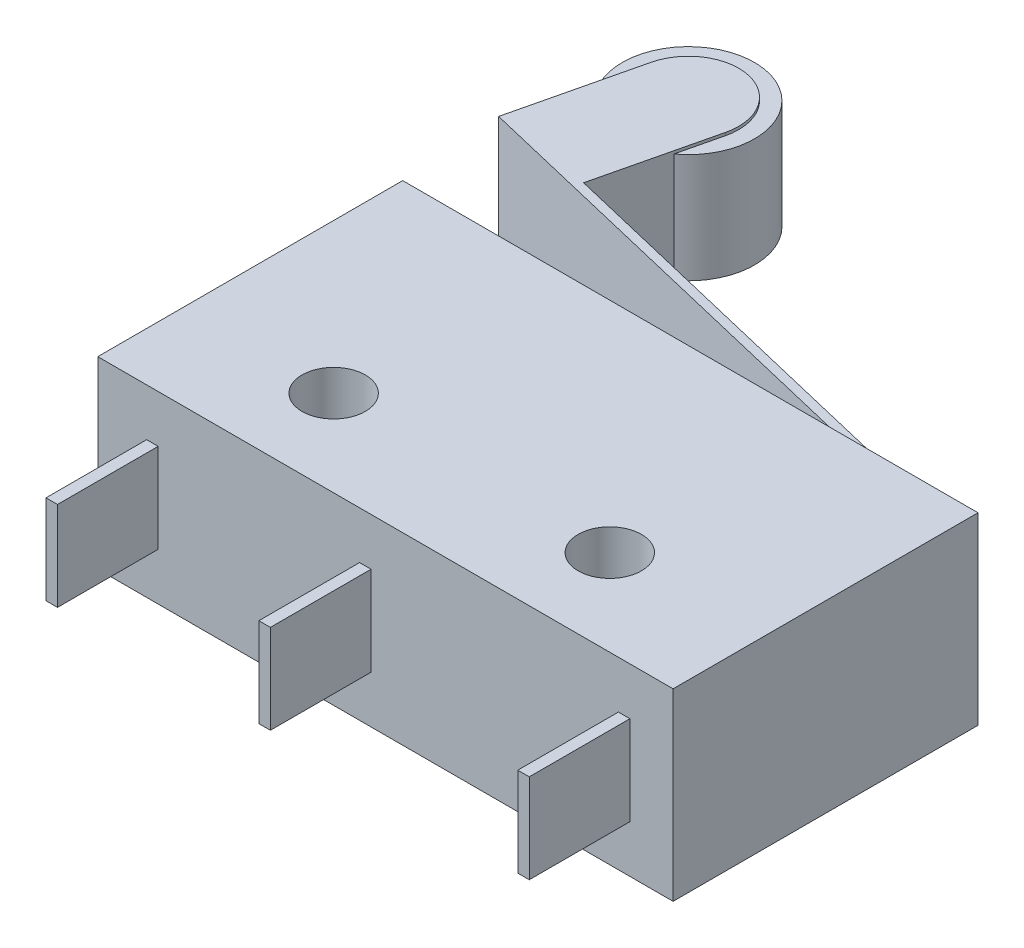
ISO-10303-21;
HEADER;
FILE_DESCRIPTION(('STEP AP214'),'2;1');
FILE_NAME('part.step','',(''),(''),'','','');
FILE_SCHEMA(('AUTOMOTIVE_DESIGN { 1 0 10303 214 1 1 1 1 }'));
ENDSEC;
DATA;
#1=APPLICATION_CONTEXT('core data for automotive mechanical design processes');
#2=APPLICATION_PROTOCOL_DEFINITION('international standard','automotive_design',2000,#1);
#3=PRODUCT_CONTEXT('',#1,'mechanical');
#4=PRODUCT('Part','Part','',(#3));
#5=PRODUCT_RELATED_PRODUCT_CATEGORY('part','',(#4));
#6=PRODUCT_DEFINITION_FORMATION('','',#4);
#7=PRODUCT_DEFINITION_CONTEXT('part definition',#1,'design');
#8=PRODUCT_DEFINITION('design','',#6,#7);
#9=PRODUCT_DEFINITION_SHAPE('','',#8);
#10=(LENGTH_UNIT() NAMED_UNIT(*) SI_UNIT(.MILLI.,.METRE.));
#11=(NAMED_UNIT(*) PLANE_ANGLE_UNIT() SI_UNIT($,.RADIAN.));
#12=(NAMED_UNIT(*) SI_UNIT($,.STERADIAN.) SOLID_ANGLE_UNIT());
#13=UNCERTAINTY_MEASURE_WITH_UNIT(LENGTH_MEASURE(1.E-05),#10,'distance_accuracy_value','');
#14=(GEOMETRIC_REPRESENTATION_CONTEXT(3) GLOBAL_UNCERTAINTY_ASSIGNED_CONTEXT((#13)) GLOBAL_UNIT_ASSIGNED_CONTEXT((#10,
#11,#12)) REPRESENTATION_CONTEXT('',''));
#15=CARTESIAN_POINT('',(0.,0.,0.));
#16=DIRECTION('',(0.,0.,1.));
#17=DIRECTION('',(1.,0.,0.));
#18=AXIS2_PLACEMENT_3D('',#15,#16,#17);
#19=CARTESIAN_POINT('',(-8.74187016503294,2.,-13.973977383716));
#20=DIRECTION('',(0.,-1.,0.));
#21=DIRECTION('',(0.,0.,-1.));
#22=AXIS2_PLACEMENT_3D('',#19,#20,#21);
#23=CYLINDRICAL_SURFACE('',#22,1.75);
#24=CARTESIAN_POINT('',(-8.74187016503294,-1.9,-13.973977383716));
#25=DIRECTION('',(0.,1.,0.));
#26=DIRECTION('',(0.,0.,1.));
#27=AXIS2_PLACEMENT_3D('',#24,#25,#26);
#28=CIRCLE('',#27,1.75);
#29=CARTESIAN_POINT('',(-7.03961337618834,-1.9,-13.5679948411942));
#30=VERTEX_POINT('',#29);
#31=CARTESIAN_POINT('',(-10.4441269538775,-1.9,-14.3799599262379));
#32=VERTEX_POINT('',#31);
#33=EDGE_CURVE('E234',#30,#32,#28,.T.);
#34=ORIENTED_EDGE('',*,*,#33,.F.);
#35=DIRECTION('',(0.,-1.,0.));
#36=VECTOR('',#35,1.);
#37=CARTESIAN_POINT('',(-7.03961337618834,2.,-13.5679948411942));
#38=LINE('',#37,#36);
#39=CARTESIAN_POINT('',(-7.03961337618834,-2.,-13.5679948411942));
#40=VERTEX_POINT('',#39);
#41=EDGE_CURVE('E290',#30,#40,#38,.T.);
#42=ORIENTED_EDGE('',*,*,#41,.T.);
#43=CARTESIAN_POINT('',(-8.74187016503294,-2.,-13.973977383716));
#44=DIRECTION('',(0.,1.,0.));
#45=DIRECTION('',(0.,0.,-1.));
#46=AXIS2_PLACEMENT_3D('',#43,#44,#45);
#47=CIRCLE('',#46,1.75);
#48=CARTESIAN_POINT('',(-10.4441269538775,-2.,-14.3799599262379));
#49=VERTEX_POINT('',#48);
#50=EDGE_CURVE('E273',#40,#49,#47,.T.);
#51=ORIENTED_EDGE('',*,*,#50,.T.);
#52=DIRECTION('',(0.,-1.,0.));
#53=VECTOR('',#52,1.);
#54=CARTESIAN_POINT('',(-10.4441269538775,2.,-14.3799599262379));
#55=LINE('',#54,#53);
#56=EDGE_CURVE('E287',#32,#49,#55,.T.);
#57=ORIENTED_EDGE('',*,*,#56,.F.);
#58=EDGE_LOOP('',(#34,#42,#51,#57));
#59=FACE_BOUND('',#58,.T.);
#60=ADVANCED_FACE('F37',(#59),#23,.T.);
#61=CARTESIAN_POINT('',(-10.,3.2,-5.3));
#62=DIRECTION('',(0.,0.,1.));
#63=DIRECTION('',(1.,0.,0.));
#64=AXIS2_PLACEMENT_3D('',#61,#62,#63);
#65=PLANE('',#64);
#66=DIRECTION('',(-1.,0.,0.));
#67=VECTOR('',#66,1.);
#68=CARTESIAN_POINT('',(-10.,-3.2,-5.3));
#69=LINE('',#68,#67);
#70=CARTESIAN_POINT('',(9.99999999999999,-3.2,-5.3));
#71=VERTEX_POINT('',#70);
#72=CARTESIAN_POINT('',(-10.,-3.2,-5.3));
#73=VERTEX_POINT('',#72);
#74=EDGE_CURVE('E425',#71,#73,#69,.T.);
#75=ORIENTED_EDGE('',*,*,#74,.T.);
#76=DIRECTION('',(0.,-1.,0.));
#77=VECTOR('',#76,1.);
#78=CARTESIAN_POINT('',(-10.,3.2,-5.3));
#79=LINE('',#78,#77);
#80=CARTESIAN_POINT('',(-10.,3.2,-5.3));
#81=VERTEX_POINT('',#80);
#82=EDGE_CURVE('E435',#81,#73,#79,.T.);
#83=ORIENTED_EDGE('',*,*,#82,.F.);
#84=DIRECTION('',(-1.,0.,0.));
#85=VECTOR('',#84,1.);
#86=CARTESIAN_POINT('',(-10.,3.2,-5.3));
#87=LINE('',#86,#85);
#88=CARTESIAN_POINT('',(9.99999999999999,3.2,-5.3));
#89=VERTEX_POINT('',#88);
#90=EDGE_CURVE('E415',#89,#81,#87,.T.);
#91=ORIENTED_EDGE('',*,*,#90,.F.);
#92=DIRECTION('',(0.,-1.,0.));
#93=VECTOR('',#92,1.);
#94=CARTESIAN_POINT('',(9.99999999999999,3.2,-5.3));
#95=LINE('',#94,#93);
#96=EDGE_CURVE('E438',#89,#71,#95,.T.);
#97=ORIENTED_EDGE('',*,*,#96,.T.);
#98=EDGE_LOOP('',(#75,#83,#91,#97));
#99=FACE_BOUND('',#98,.T.);
#100=DIRECTION('',(1.,0.,0.));
#101=VECTOR('',#100,1.);
#102=CARTESIAN_POINT('',(-10.,2.,-5.3));
#103=LINE('',#102,#101);
#104=CARTESIAN_POINT('',(6.29999999999999,2.,-5.3));
#105=VERTEX_POINT('',#104);
#106=CARTESIAN_POINT('',(6.59999999999999,2.,-5.3));
#107=VERTEX_POINT('',#106);
#108=EDGE_CURVE('E235',#105,#107,#103,.T.);
#109=ORIENTED_EDGE('',*,*,#108,.F.);
#110=DIRECTION('',(0.,1.,0.));
#111=VECTOR('',#110,1.);
#112=CARTESIAN_POINT('',(6.3,3.2,-5.3));
#113=LINE('',#112,#111);
#114=CARTESIAN_POINT('',(6.29999999999999,-2.,-5.3));
#115=VERTEX_POINT('',#114);
#116=EDGE_CURVE('E444',#115,#105,#113,.T.);
#117=ORIENTED_EDGE('',*,*,#116,.F.);
#118=DIRECTION('',(1.,0.,0.));
#119=VECTOR('',#118,1.);
#120=CARTESIAN_POINT('',(-10.,-2.,-5.3));
#121=LINE('',#120,#119);
#122=CARTESIAN_POINT('',(6.59999999999999,-2.,-5.3));
#123=VERTEX_POINT('',#122);
#124=EDGE_CURVE('E441',#115,#123,#121,.T.);
#125=ORIENTED_EDGE('',*,*,#124,.T.);
#126=DIRECTION('',(0.,-1.,0.));
#127=VECTOR('',#126,1.);
#128=CARTESIAN_POINT('',(6.59999999999999,3.2,-5.3));
#129=LINE('',#128,#127);
#130=EDGE_CURVE('E446',#107,#123,#129,.T.);
#131=ORIENTED_EDGE('',*,*,#130,.F.);
#132=EDGE_LOOP('',(#109,#117,#125,#131));
#133=FACE_BOUND('',#132,.T.);
#134=ADVANCED_FACE('F461',(#99,#133),#65,.F.);
#135=CARTESIAN_POINT('',(-10.,3.2,5.3));
#136=DIRECTION('',(0.,0.,-1.));
#137=DIRECTION('',(-1.,0.,0.));
#138=AXIS2_PLACEMENT_3D('',#135,#136,#137);
#139=PLANE('',#138);
#140=DIRECTION('',(0.,1.,0.));
#141=VECTOR('',#140,1.);
#142=CARTESIAN_POINT('',(-0.500000000000006,-1.55,5.3));
#143=LINE('',#142,#141);
#144=CARTESIAN_POINT('',(-0.500000000000006,-1.55,5.3));
#145=VERTEX_POINT('',#144);
#146=CARTESIAN_POINT('',(-0.500000000000006,1.55,5.3));
#147=VERTEX_POINT('',#146);
#148=EDGE_CURVE('E333',#145,#147,#143,.T.);
#149=ORIENTED_EDGE('',*,*,#148,.F.);
#150=DIRECTION('',(1.,0.,0.));
#151=VECTOR('',#150,1.);
#152=CARTESIAN_POINT('',(-0.900000000000005,-1.55,5.3));
#153=LINE('',#152,#151);
#154=CARTESIAN_POINT('',(-0.900000000000005,-1.55,5.3));
#155=VERTEX_POINT('',#154);
#156=EDGE_CURVE('E338',#155,#145,#153,.T.);
#157=ORIENTED_EDGE('',*,*,#156,.F.);
#158=DIRECTION('',(0.,-1.,0.));
#159=VECTOR('',#158,1.);
#160=CARTESIAN_POINT('',(-0.900000000000005,-1.55,5.3));
#161=LINE('',#160,#159);
#162=CARTESIAN_POINT('',(-0.900000000000005,1.55,5.3));
#163=VERTEX_POINT('',#162);
#164=EDGE_CURVE('E350',#163,#155,#161,.T.);
#165=ORIENTED_EDGE('',*,*,#164,.F.);
#166=DIRECTION('',(-1.,0.,0.));
#167=VECTOR('',#166,1.);
#168=CARTESIAN_POINT('',(-0.900000000000005,1.55,5.3));
#169=LINE('',#168,#167);
#170=EDGE_CURVE('E347',#147,#163,#169,.T.);
#171=ORIENTED_EDGE('',*,*,#170,.F.);
#172=EDGE_LOOP('',(#149,#157,#165,#171));
#173=FACE_BOUND('',#172,.T.);
#174=DIRECTION('',(1.,0.,0.));
#175=VECTOR('',#174,1.);
#176=CARTESIAN_POINT('',(-10.,-3.2,5.3));
#177=LINE('',#176,#175);
#178=CARTESIAN_POINT('',(-10.,-3.2,5.3));
#179=VERTEX_POINT('',#178);
#180=CARTESIAN_POINT('',(9.99999999999999,-3.2,5.3));
#181=VERTEX_POINT('',#180);
#182=EDGE_CURVE('E416',#179,#181,#177,.T.);
#183=ORIENTED_EDGE('',*,*,#182,.T.);
#184=DIRECTION('',(0.,-1.,0.));
#185=VECTOR('',#184,1.);
#186=CARTESIAN_POINT('',(9.99999999999999,3.2,5.3));
#187=LINE('',#186,#185);
#188=CARTESIAN_POINT('',(9.99999999999999,3.2,5.3));
#189=VERTEX_POINT('',#188);
#190=EDGE_CURVE('E422',#189,#181,#187,.T.);
#191=ORIENTED_EDGE('',*,*,#190,.F.);
#192=DIRECTION('',(1.,0.,0.));
#193=VECTOR('',#192,1.);
#194=CARTESIAN_POINT('',(-10.,3.2,5.3));
#195=LINE('',#194,#193);
#196=CARTESIAN_POINT('',(-10.,3.2,5.3));
#197=VERTEX_POINT('',#196);
#198=EDGE_CURVE('E420',#197,#189,#195,.T.);
#199=ORIENTED_EDGE('',*,*,#198,.F.);
#200=DIRECTION('',(0.,-1.,0.));
#201=VECTOR('',#200,1.);
#202=CARTESIAN_POINT('',(-10.,3.2,5.3));
#203=LINE('',#202,#201);
#204=EDGE_CURVE('E432',#197,#179,#203,.T.);
#205=ORIENTED_EDGE('',*,*,#204,.T.);
#206=EDGE_LOOP('',(#183,#191,#199,#205));
#207=FACE_BOUND('',#206,.T.);
#208=DIRECTION('',(0.,1.,0.));
#209=VECTOR('',#208,1.);
#210=CARTESIAN_POINT('',(-7.90000000000001,-1.55,5.3));
#211=LINE('',#210,#209);
#212=CARTESIAN_POINT('',(-7.90000000000001,-1.55,5.3));
#213=VERTEX_POINT('',#212);
#214=CARTESIAN_POINT('',(-7.90000000000001,1.55,5.3));
#215=VERTEX_POINT('',#214);
#216=EDGE_CURVE('E366',#213,#215,#211,.T.);
#217=ORIENTED_EDGE('',*,*,#216,.F.);
#218=DIRECTION('',(1.,0.,0.));
#219=VECTOR('',#218,1.);
#220=CARTESIAN_POINT('',(-8.30000000000001,-1.55,5.3));
#221=LINE('',#220,#219);
#222=CARTESIAN_POINT('',(-8.30000000000001,-1.55,5.3));
#223=VERTEX_POINT('',#222);
#224=EDGE_CURVE('E371',#223,#213,#221,.T.);
#225=ORIENTED_EDGE('',*,*,#224,.F.);
#226=DIRECTION('',(0.,-1.,0.));
#227=VECTOR('',#226,1.);
#228=CARTESIAN_POINT('',(-8.30000000000001,-1.55,5.3));
#229=LINE('',#228,#227);
#230=CARTESIAN_POINT('',(-8.30000000000001,1.55,5.3));
#231=VERTEX_POINT('',#230);
#232=EDGE_CURVE('E383',#231,#223,#229,.T.);
#233=ORIENTED_EDGE('',*,*,#232,.F.);
#234=DIRECTION('',(-1.,0.,0.));
#235=VECTOR('',#234,1.);
#236=CARTESIAN_POINT('',(-8.30000000000001,1.55,5.3));
#237=LINE('',#236,#235);
#238=EDGE_CURVE('E380',#215,#231,#237,.T.);
#239=ORIENTED_EDGE('',*,*,#238,.F.);
#240=EDGE_LOOP('',(#217,#225,#233,#239));
#241=FACE_BOUND('',#240,.T.);
#242=DIRECTION('',(0.,1.,0.));
#243=VECTOR('',#242,1.);
#244=CARTESIAN_POINT('',(8.49999999999999,-1.55,5.3));
#245=LINE('',#244,#243);
#246=CARTESIAN_POINT('',(8.49999999999999,-1.55,5.3));
#247=VERTEX_POINT('',#246);
#248=CARTESIAN_POINT('',(8.49999999999999,1.55,5.3));
#249=VERTEX_POINT('',#248);
#250=EDGE_CURVE('E300',#247,#249,#245,.T.);
#251=ORIENTED_EDGE('',*,*,#250,.F.);
#252=DIRECTION('',(1.,0.,0.));
#253=VECTOR('',#252,1.);
#254=CARTESIAN_POINT('',(8.1,-1.55,5.3));
#255=LINE('',#254,#253);
#256=CARTESIAN_POINT('',(8.1,-1.55,5.3));
#257=VERTEX_POINT('',#256);
#258=EDGE_CURVE('E305',#257,#247,#255,.T.);
#259=ORIENTED_EDGE('',*,*,#258,.F.);
#260=DIRECTION('',(0.,-1.,0.));
#261=VECTOR('',#260,1.);
#262=CARTESIAN_POINT('',(8.1,-1.55,5.3));
#263=LINE('',#262,#261);
#264=CARTESIAN_POINT('',(8.1,1.55,5.3));
#265=VERTEX_POINT('',#264);
#266=EDGE_CURVE('E317',#265,#257,#263,.T.);
#267=ORIENTED_EDGE('',*,*,#266,.F.);
#268=DIRECTION('',(-1.,0.,0.));
#269=VECTOR('',#268,1.);
#270=CARTESIAN_POINT('',(8.1,1.55,5.3));
#271=LINE('',#270,#269);
#272=EDGE_CURVE('E314',#249,#265,#271,.T.);
#273=ORIENTED_EDGE('',*,*,#272,.F.);
#274=EDGE_LOOP('',(#251,#259,#267,#273));
#275=FACE_BOUND('',#274,.T.);
#276=ADVANCED_FACE('F505',(#173,#207,#241,#275),#139,.F.);
#277=CARTESIAN_POINT('',(0.,3.2,0.));
#278=DIRECTION('',(0.,-1.,0.));
#279=DIRECTION('',(0.,0.,-1.));
#280=AXIS2_PLACEMENT_3D('',#277,#278,#279);
#281=PLANE('',#280);
#282=DIRECTION('',(0.,0.,-1.));
#283=VECTOR('',#282,1.);
#284=CARTESIAN_POINT('',(9.99999999999999,3.2,5.3));
#285=LINE('',#284,#283);
#286=EDGE_CURVE('E412',#189,#89,#285,.T.);
#287=ORIENTED_EDGE('',*,*,#286,.T.);
#288=ORIENTED_EDGE('',*,*,#90,.T.);
#289=DIRECTION('',(0.,0.,1.));
#290=VECTOR('',#289,1.);
#291=CARTESIAN_POINT('',(-10.,3.2,5.3));
#292=LINE('',#291,#290);
#293=EDGE_CURVE('E418',#81,#197,#292,.T.);
#294=ORIENTED_EDGE('',*,*,#293,.T.);
#295=ORIENTED_EDGE('',*,*,#198,.T.);
#296=EDGE_LOOP('',(#287,#288,#294,#295));
#297=FACE_BOUND('',#296,.T.);
#298=CARTESIAN_POINT('',(-4.80000000000001,3.2,2.3));
#299=DIRECTION('',(0.,1.,0.));
#300=DIRECTION('',(0.,0.,1.));
#301=AXIS2_PLACEMENT_3D('',#298,#299,#300);
#302=CIRCLE('',#301,1.1);
#303=CARTESIAN_POINT('',(-4.80000000000001,3.2,3.4));
#304=VERTEX_POINT('',#303);
#305=EDGE_CURVE('E406',#304,#304,#302,.T.);
#306=ORIENTED_EDGE('',*,*,#305,.F.);
#307=EDGE_LOOP('',(#306));
#308=FACE_BOUND('',#307,.T.);
#309=CARTESIAN_POINT('',(4.8,3.2,2.3));
#310=DIRECTION('',(0.,1.,0.));
#311=DIRECTION('',(0.,0.,1.));
#312=AXIS2_PLACEMENT_3D('',#309,#310,#311);
#313=CIRCLE('',#312,1.1);
#314=CARTESIAN_POINT('',(4.8,3.2,3.4));
#315=VERTEX_POINT('',#314);
#316=EDGE_CURVE('E400',#315,#315,#313,.T.);
#317=ORIENTED_EDGE('',*,*,#316,.F.);
#318=EDGE_LOOP('',(#317));
#319=FACE_BOUND('',#318,.T.);
#320=ADVANCED_FACE('F590',(#297,#308,#319),#281,.F.);
#321=CARTESIAN_POINT('',(0.,-3.2,0.));
#322=DIRECTION('',(0.,-1.,0.));
#323=DIRECTION('',(0.,0.,-1.));
#324=AXIS2_PLACEMENT_3D('',#321,#322,#323);
#325=PLANE('',#324);
#326=CARTESIAN_POINT('',(-4.80000000000001,-3.2,2.3));
#327=DIRECTION('',(0.,1.,0.));
#328=DIRECTION('',(0.,0.,1.));
#329=AXIS2_PLACEMENT_3D('',#326,#327,#328);
#330=CIRCLE('',#329,1.1);
#331=CARTESIAN_POINT('',(-4.80000000000001,-3.2,3.4));
#332=VERTEX_POINT('',#331);
#333=EDGE_CURVE('E403',#332,#332,#330,.T.);
#334=ORIENTED_EDGE('',*,*,#333,.T.);
#335=EDGE_LOOP('',(#334));
#336=FACE_BOUND('',#335,.T.);
#337=DIRECTION('',(0.,0.,-1.));
#338=VECTOR('',#337,1.);
#339=CARTESIAN_POINT('',(9.99999999999999,-3.2,5.3));
#340=LINE('',#339,#338);
#341=EDGE_CURVE('E409',#181,#71,#340,.T.);
#342=ORIENTED_EDGE('',*,*,#341,.F.);
#343=ORIENTED_EDGE('',*,*,#182,.F.);
#344=DIRECTION('',(0.,0.,1.));
#345=VECTOR('',#344,1.);
#346=CARTESIAN_POINT('',(-10.,-3.2,5.3));
#347=LINE('',#346,#345);
#348=EDGE_CURVE('E427',#73,#179,#347,.T.);
#349=ORIENTED_EDGE('',*,*,#348,.F.);
#350=ORIENTED_EDGE('',*,*,#74,.F.);
#351=EDGE_LOOP('',(#342,#343,#349,#350));
#352=FACE_BOUND('',#351,.T.);
#353=CARTESIAN_POINT('',(4.8,-3.2,2.3));
#354=DIRECTION('',(0.,1.,0.));
#355=DIRECTION('',(0.,0.,1.));
#356=AXIS2_PLACEMENT_3D('',#353,#354,#355);
#357=CIRCLE('',#356,1.1);
#358=CARTESIAN_POINT('',(4.8,-3.2,3.4));
#359=VERTEX_POINT('',#358);
#360=EDGE_CURVE('E399',#359,#359,#357,.T.);
#361=ORIENTED_EDGE('',*,*,#360,.T.);
#362=EDGE_LOOP('',(#361));
#363=FACE_BOUND('',#362,.T.);
#364=ADVANCED_FACE('F593',(#336,#352,#363),#325,.T.);
#365=CARTESIAN_POINT('',(9.99999999999999,3.2,5.3));
#366=DIRECTION('',(-1.,0.,0.));
#367=DIRECTION('',(0.,0.,1.));
#368=AXIS2_PLACEMENT_3D('',#365,#366,#367);
#369=PLANE('',#368);
#370=ORIENTED_EDGE('',*,*,#341,.T.);
#371=ORIENTED_EDGE('',*,*,#96,.F.);
#372=ORIENTED_EDGE('',*,*,#286,.F.);
#373=ORIENTED_EDGE('',*,*,#190,.T.);
#374=EDGE_LOOP('',(#370,#371,#372,#373));
#375=FACE_BOUND('',#374,.T.);
#376=ADVANCED_FACE('F39',(#375),#369,.F.);
#377=CARTESIAN_POINT('',(-10.,3.2,5.3));
#378=DIRECTION('',(1.,0.,0.));
#379=DIRECTION('',(0.,0.,-1.));
#380=AXIS2_PLACEMENT_3D('',#377,#378,#379);
#381=PLANE('',#380);
#382=ORIENTED_EDGE('',*,*,#348,.T.);
#383=ORIENTED_EDGE('',*,*,#204,.F.);
#384=ORIENTED_EDGE('',*,*,#293,.F.);
#385=ORIENTED_EDGE('',*,*,#82,.T.);
#386=EDGE_LOOP('',(#382,#383,#384,#385));
#387=FACE_BOUND('',#386,.T.);
#388=ADVANCED_FACE('F588',(#387),#381,.F.);
#389=CARTESIAN_POINT('',(-4.80000000000001,3.2,2.3));
#390=DIRECTION('',(0.,-1.,0.));
#391=DIRECTION('',(0.,0.,-1.));
#392=AXIS2_PLACEMENT_3D('',#389,#390,#391);
#393=CYLINDRICAL_SURFACE('',#392,1.1);
#394=ORIENTED_EDGE('',*,*,#305,.T.);
#395=EDGE_LOOP('',(#394));
#396=FACE_BOUND('',#395,.T.);
#397=ORIENTED_EDGE('',*,*,#333,.F.);
#398=EDGE_LOOP('',(#397));
#399=FACE_BOUND('',#398,.T.);
#400=ADVANCED_FACE('F584',(#396,#399),#393,.F.);
#401=CARTESIAN_POINT('',(4.8,3.2,2.3));
#402=DIRECTION('',(0.,-1.,0.));
#403=DIRECTION('',(0.,0.,-1.));
#404=AXIS2_PLACEMENT_3D('',#401,#402,#403);
#405=CYLINDRICAL_SURFACE('',#404,1.1);
#406=ORIENTED_EDGE('',*,*,#316,.T.);
#407=EDGE_LOOP('',(#406));
#408=FACE_BOUND('',#407,.T.);
#409=ORIENTED_EDGE('',*,*,#360,.F.);
#410=EDGE_LOOP('',(#409));
#411=FACE_BOUND('',#410,.T.);
#412=ADVANCED_FACE('F580',(#408,#411),#405,.F.);
#413=CARTESIAN_POINT('',(-7.90000000000001,-1.55,8.8));
#414=DIRECTION('',(-1.,0.,0.));
#415=DIRECTION('',(0.,0.,1.));
#416=AXIS2_PLACEMENT_3D('',#413,#414,#415);
#417=PLANE('',#416);
#418=ORIENTED_EDGE('',*,*,#216,.T.);
#419=DIRECTION('',(0.,0.,-1.));
#420=VECTOR('',#419,1.);
#421=CARTESIAN_POINT('',(-7.90000000000001,1.55,8.8));
#422=LINE('',#421,#420);
#423=CARTESIAN_POINT('',(-7.90000000000001,1.55,8.8));
#424=VERTEX_POINT('',#423);
#425=EDGE_CURVE('E396',#424,#215,#422,.T.);
#426=ORIENTED_EDGE('',*,*,#425,.F.);
#427=DIRECTION('',(0.,1.,0.));
#428=VECTOR('',#427,1.);
#429=CARTESIAN_POINT('',(-7.90000000000001,-1.55,8.8));
#430=LINE('',#429,#428);
#431=CARTESIAN_POINT('',(-7.90000000000001,-1.55,8.8));
#432=VERTEX_POINT('',#431);
#433=EDGE_CURVE('E367',#432,#424,#430,.T.);
#434=ORIENTED_EDGE('',*,*,#433,.F.);
#435=DIRECTION('',(0.,0.,-1.));
#436=VECTOR('',#435,1.);
#437=CARTESIAN_POINT('',(-7.90000000000001,-1.55,8.8));
#438=LINE('',#437,#436);
#439=EDGE_CURVE('E377',#432,#213,#438,.T.);
#440=ORIENTED_EDGE('',*,*,#439,.T.);
#441=EDGE_LOOP('',(#418,#426,#434,#440));
#442=FACE_BOUND('',#441,.T.);
#443=ADVANCED_FACE('F576',(#442),#417,.F.);
#444=CARTESIAN_POINT('',(-8.30000000000001,1.55,8.8));
#445=DIRECTION('',(0.,-1.,0.));
#446=DIRECTION('',(0.,0.,-1.));
#447=AXIS2_PLACEMENT_3D('',#444,#445,#446);
#448=PLANE('',#447);
#449=ORIENTED_EDGE('',*,*,#238,.T.);
#450=DIRECTION('',(0.,0.,-1.));
#451=VECTOR('',#450,1.);
#452=CARTESIAN_POINT('',(-8.30000000000001,1.55,8.8));
#453=LINE('',#452,#451);
#454=CARTESIAN_POINT('',(-8.30000000000001,1.55,8.8));
#455=VERTEX_POINT('',#454);
#456=EDGE_CURVE('E393',#455,#231,#453,.T.);
#457=ORIENTED_EDGE('',*,*,#456,.F.);
#458=DIRECTION('',(-1.,0.,0.));
#459=VECTOR('',#458,1.);
#460=CARTESIAN_POINT('',(-8.30000000000001,1.55,8.8));
#461=LINE('',#460,#459);
#462=EDGE_CURVE('E370',#424,#455,#461,.T.);
#463=ORIENTED_EDGE('',*,*,#462,.F.);
#464=ORIENTED_EDGE('',*,*,#425,.T.);
#465=EDGE_LOOP('',(#449,#457,#463,#464));
#466=FACE_BOUND('',#465,.T.);
#467=ADVANCED_FACE('F572',(#466),#448,.F.);
#468=CARTESIAN_POINT('',(-8.30000000000001,-1.55,8.8));
#469=DIRECTION('',(1.,0.,0.));
#470=DIRECTION('',(0.,0.,-1.));
#471=AXIS2_PLACEMENT_3D('',#468,#469,#470);
#472=PLANE('',#471);
#473=ORIENTED_EDGE('',*,*,#232,.T.);
#474=DIRECTION('',(0.,0.,-1.));
#475=VECTOR('',#474,1.);
#476=CARTESIAN_POINT('',(-8.30000000000001,-1.55,8.8));
#477=LINE('',#476,#475);
#478=CARTESIAN_POINT('',(-8.30000000000001,-1.55,8.8));
#479=VERTEX_POINT('',#478);
#480=EDGE_CURVE('E390',#479,#223,#477,.T.);
#481=ORIENTED_EDGE('',*,*,#480,.F.);
#482=DIRECTION('',(0.,-1.,0.));
#483=VECTOR('',#482,1.);
#484=CARTESIAN_POINT('',(-8.30000000000001,-1.55,8.8));
#485=LINE('',#484,#483);
#486=EDGE_CURVE('E373',#455,#479,#485,.T.);
#487=ORIENTED_EDGE('',*,*,#486,.F.);
#488=ORIENTED_EDGE('',*,*,#456,.T.);
#489=EDGE_LOOP('',(#473,#481,#487,#488));
#490=FACE_BOUND('',#489,.T.);
#491=ADVANCED_FACE('F568',(#490),#472,.F.);
#492=CARTESIAN_POINT('',(-8.30000000000001,-1.55,8.8));
#493=DIRECTION('',(0.,1.,0.));
#494=DIRECTION('',(0.,0.,1.));
#495=AXIS2_PLACEMENT_3D('',#492,#493,#494);
#496=PLANE('',#495);
#497=ORIENTED_EDGE('',*,*,#224,.T.);
#498=ORIENTED_EDGE('',*,*,#439,.F.);
#499=DIRECTION('',(1.,0.,0.));
#500=VECTOR('',#499,1.);
#501=CARTESIAN_POINT('',(-8.30000000000001,-1.55,8.8));
#502=LINE('',#501,#500);
#503=EDGE_CURVE('E375',#479,#432,#502,.T.);
#504=ORIENTED_EDGE('',*,*,#503,.F.);
#505=ORIENTED_EDGE('',*,*,#480,.T.);
#506=EDGE_LOOP('',(#497,#498,#504,#505));
#507=FACE_BOUND('',#506,.T.);
#508=ADVANCED_FACE('F564',(#507),#496,.F.);
#509=CARTESIAN_POINT('',(0.,0.,8.8));
#510=DIRECTION('',(0.,0.,-1.));
#511=DIRECTION('',(-1.,0.,0.));
#512=AXIS2_PLACEMENT_3D('',#509,#510,#511);
#513=PLANE('',#512);
#514=ORIENTED_EDGE('',*,*,#433,.T.);
#515=ORIENTED_EDGE('',*,*,#462,.T.);
#516=ORIENTED_EDGE('',*,*,#486,.T.);
#517=ORIENTED_EDGE('',*,*,#503,.T.);
#518=EDGE_LOOP('',(#514,#515,#516,#517));
#519=FACE_BOUND('',#518,.T.);
#520=ADVANCED_FACE('F560',(#519),#513,.F.);
#521=CARTESIAN_POINT('',(-0.500000000000006,-1.55,8.8));
#522=DIRECTION('',(-1.,0.,0.));
#523=DIRECTION('',(0.,0.,1.));
#524=AXIS2_PLACEMENT_3D('',#521,#522,#523);
#525=PLANE('',#524);
#526=ORIENTED_EDGE('',*,*,#148,.T.);
#527=DIRECTION('',(0.,0.,-1.));
#528=VECTOR('',#527,1.);
#529=CARTESIAN_POINT('',(-0.500000000000006,1.55,8.8));
#530=LINE('',#529,#528);
#531=CARTESIAN_POINT('',(-0.500000000000006,1.55,8.8));
#532=VERTEX_POINT('',#531);
#533=EDGE_CURVE('E363',#532,#147,#530,.T.);
#534=ORIENTED_EDGE('',*,*,#533,.F.);
#535=DIRECTION('',(0.,1.,0.));
#536=VECTOR('',#535,1.);
#537=CARTESIAN_POINT('',(-0.500000000000006,-1.55,8.8));
#538=LINE('',#537,#536);
#539=CARTESIAN_POINT('',(-0.500000000000006,-1.55,8.8));
#540=VERTEX_POINT('',#539);
#541=EDGE_CURVE('E334',#540,#532,#538,.T.);
#542=ORIENTED_EDGE('',*,*,#541,.F.);
#543=DIRECTION('',(0.,0.,-1.));
#544=VECTOR('',#543,1.);
#545=CARTESIAN_POINT('',(-0.500000000000006,-1.55,8.8));
#546=LINE('',#545,#544);
#547=EDGE_CURVE('E344',#540,#145,#546,.T.);
#548=ORIENTED_EDGE('',*,*,#547,.T.);
#549=EDGE_LOOP('',(#526,#534,#542,#548));
#550=FACE_BOUND('',#549,.T.);
#551=ADVANCED_FACE('F556',(#550),#525,.F.);
#552=CARTESIAN_POINT('',(-0.900000000000005,1.55,8.8));
#553=DIRECTION('',(0.,-1.,0.));
#554=DIRECTION('',(0.,0.,-1.));
#555=AXIS2_PLACEMENT_3D('',#552,#553,#554);
#556=PLANE('',#555);
#557=ORIENTED_EDGE('',*,*,#170,.T.);
#558=DIRECTION('',(0.,0.,-1.));
#559=VECTOR('',#558,1.);
#560=CARTESIAN_POINT('',(-0.900000000000005,1.55,8.8));
#561=LINE('',#560,#559);
#562=CARTESIAN_POINT('',(-0.900000000000005,1.55,8.8));
#563=VERTEX_POINT('',#562);
#564=EDGE_CURVE('E360',#563,#163,#561,.T.);
#565=ORIENTED_EDGE('',*,*,#564,.F.);
#566=DIRECTION('',(-1.,0.,0.));
#567=VECTOR('',#566,1.);
#568=CARTESIAN_POINT('',(-0.900000000000005,1.55,8.8));
#569=LINE('',#568,#567);
#570=EDGE_CURVE('E337',#532,#563,#569,.T.);
#571=ORIENTED_EDGE('',*,*,#570,.F.);
#572=ORIENTED_EDGE('',*,*,#533,.T.);
#573=EDGE_LOOP('',(#557,#565,#571,#572));
#574=FACE_BOUND('',#573,.T.);
#575=ADVANCED_FACE('F552',(#574),#556,.F.);
#576=CARTESIAN_POINT('',(-0.900000000000005,-1.55,8.8));
#577=DIRECTION('',(1.,0.,0.));
#578=DIRECTION('',(0.,0.,-1.));
#579=AXIS2_PLACEMENT_3D('',#576,#577,#578);
#580=PLANE('',#579);
#581=ORIENTED_EDGE('',*,*,#164,.T.);
#582=DIRECTION('',(0.,0.,-1.));
#583=VECTOR('',#582,1.);
#584=CARTESIAN_POINT('',(-0.900000000000005,-1.55,8.8));
#585=LINE('',#584,#583);
#586=CARTESIAN_POINT('',(-0.900000000000005,-1.55,8.8));
#587=VERTEX_POINT('',#586);
#588=EDGE_CURVE('E357',#587,#155,#585,.T.);
#589=ORIENTED_EDGE('',*,*,#588,.F.);
#590=DIRECTION('',(0.,-1.,0.));
#591=VECTOR('',#590,1.);
#592=CARTESIAN_POINT('',(-0.900000000000005,-1.55,8.8));
#593=LINE('',#592,#591);
#594=EDGE_CURVE('E340',#563,#587,#593,.T.);
#595=ORIENTED_EDGE('',*,*,#594,.F.);
#596=ORIENTED_EDGE('',*,*,#564,.T.);
#597=EDGE_LOOP('',(#581,#589,#595,#596));
#598=FACE_BOUND('',#597,.T.);
#599=ADVANCED_FACE('F548',(#598),#580,.F.);
#600=CARTESIAN_POINT('',(-0.900000000000005,-1.55,8.8));
#601=DIRECTION('',(0.,1.,0.));
#602=DIRECTION('',(0.,0.,1.));
#603=AXIS2_PLACEMENT_3D('',#600,#601,#602);
#604=PLANE('',#603);
#605=ORIENTED_EDGE('',*,*,#156,.T.);
#606=ORIENTED_EDGE('',*,*,#547,.F.);
#607=DIRECTION('',(1.,0.,0.));
#608=VECTOR('',#607,1.);
#609=CARTESIAN_POINT('',(-0.900000000000005,-1.55,8.8));
#610=LINE('',#609,#608);
#611=EDGE_CURVE('E342',#587,#540,#610,.T.);
#612=ORIENTED_EDGE('',*,*,#611,.F.);
#613=ORIENTED_EDGE('',*,*,#588,.T.);
#614=EDGE_LOOP('',(#605,#606,#612,#613));
#615=FACE_BOUND('',#614,.T.);
#616=ADVANCED_FACE('F544',(#615),#604,.F.);
#617=CARTESIAN_POINT('',(0.,0.,8.8));
#618=DIRECTION('',(0.,0.,-1.));
#619=DIRECTION('',(-1.,0.,0.));
#620=AXIS2_PLACEMENT_3D('',#617,#618,#619);
#621=PLANE('',#620);
#622=ORIENTED_EDGE('',*,*,#541,.T.);
#623=ORIENTED_EDGE('',*,*,#570,.T.);
#624=ORIENTED_EDGE('',*,*,#594,.T.);
#625=ORIENTED_EDGE('',*,*,#611,.T.);
#626=EDGE_LOOP('',(#622,#623,#624,#625));
#627=FACE_BOUND('',#626,.T.);
#628=ADVANCED_FACE('F540',(#627),#621,.F.);
#629=CARTESIAN_POINT('',(8.49999999999999,-1.55,8.8));
#630=DIRECTION('',(-1.,0.,0.));
#631=DIRECTION('',(0.,0.,1.));
#632=AXIS2_PLACEMENT_3D('',#629,#630,#631);
#633=PLANE('',#632);
#634=ORIENTED_EDGE('',*,*,#250,.T.);
#635=DIRECTION('',(0.,0.,-1.));
#636=VECTOR('',#635,1.);
#637=CARTESIAN_POINT('',(8.49999999999999,1.55,8.8));
#638=LINE('',#637,#636);
#639=CARTESIAN_POINT('',(8.49999999999999,1.55,8.8));
#640=VERTEX_POINT('',#639);
#641=EDGE_CURVE('E330',#640,#249,#638,.T.);
#642=ORIENTED_EDGE('',*,*,#641,.F.);
#643=DIRECTION('',(0.,1.,0.));
#644=VECTOR('',#643,1.);
#645=CARTESIAN_POINT('',(8.49999999999999,-1.55,8.8));
#646=LINE('',#645,#644);
#647=CARTESIAN_POINT('',(8.49999999999999,-1.55,8.8));
#648=VERTEX_POINT('',#647);
#649=EDGE_CURVE('E301',#648,#640,#646,.T.);
#650=ORIENTED_EDGE('',*,*,#649,.F.);
#651=DIRECTION('',(0.,0.,-1.));
#652=VECTOR('',#651,1.);
#653=CARTESIAN_POINT('',(8.49999999999999,-1.55,8.8));
#654=LINE('',#653,#652);
#655=EDGE_CURVE('E311',#648,#247,#654,.T.);
#656=ORIENTED_EDGE('',*,*,#655,.T.);
#657=EDGE_LOOP('',(#634,#642,#650,#656));
#658=FACE_BOUND('',#657,.T.);
#659=ADVANCED_FACE('F536',(#658),#633,.F.);
#660=CARTESIAN_POINT('',(8.1,1.55,8.8));
#661=DIRECTION('',(0.,-1.,0.));
#662=DIRECTION('',(0.,0.,-1.));
#663=AXIS2_PLACEMENT_3D('',#660,#661,#662);
#664=PLANE('',#663);
#665=ORIENTED_EDGE('',*,*,#272,.T.);
#666=DIRECTION('',(0.,0.,-1.));
#667=VECTOR('',#666,1.);
#668=CARTESIAN_POINT('',(8.1,1.55,8.8));
#669=LINE('',#668,#667);
#670=CARTESIAN_POINT('',(8.1,1.55,8.8));
#671=VERTEX_POINT('',#670);
#672=EDGE_CURVE('E327',#671,#265,#669,.T.);
#673=ORIENTED_EDGE('',*,*,#672,.F.);
#674=DIRECTION('',(-1.,0.,0.));
#675=VECTOR('',#674,1.);
#676=CARTESIAN_POINT('',(8.1,1.55,8.8));
#677=LINE('',#676,#675);
#678=EDGE_CURVE('E304',#640,#671,#677,.T.);
#679=ORIENTED_EDGE('',*,*,#678,.F.);
#680=ORIENTED_EDGE('',*,*,#641,.T.);
#681=EDGE_LOOP('',(#665,#673,#679,#680));
#682=FACE_BOUND('',#681,.T.);
#683=ADVANCED_FACE('F532',(#682),#664,.F.);
#684=CARTESIAN_POINT('',(8.1,-1.55,8.8));
#685=DIRECTION('',(1.,0.,0.));
#686=DIRECTION('',(0.,0.,-1.));
#687=AXIS2_PLACEMENT_3D('',#684,#685,#686);
#688=PLANE('',#687);
#689=ORIENTED_EDGE('',*,*,#266,.T.);
#690=DIRECTION('',(0.,0.,-1.));
#691=VECTOR('',#690,1.);
#692=CARTESIAN_POINT('',(8.1,-1.55,8.8));
#693=LINE('',#692,#691);
#694=CARTESIAN_POINT('',(8.1,-1.55,8.8));
#695=VERTEX_POINT('',#694);
#696=EDGE_CURVE('E324',#695,#257,#693,.T.);
#697=ORIENTED_EDGE('',*,*,#696,.F.);
#698=DIRECTION('',(0.,-1.,0.));
#699=VECTOR('',#698,1.);
#700=CARTESIAN_POINT('',(8.1,-1.55,8.8));
#701=LINE('',#700,#699);
#702=EDGE_CURVE('E307',#671,#695,#701,.T.);
#703=ORIENTED_EDGE('',*,*,#702,.F.);
#704=ORIENTED_EDGE('',*,*,#672,.T.);
#705=EDGE_LOOP('',(#689,#697,#703,#704));
#706=FACE_BOUND('',#705,.T.);
#707=ADVANCED_FACE('F528',(#706),#688,.F.);
#708=CARTESIAN_POINT('',(8.1,-1.55,8.8));
#709=DIRECTION('',(0.,1.,0.));
#710=DIRECTION('',(0.,0.,1.));
#711=AXIS2_PLACEMENT_3D('',#708,#709,#710);
#712=PLANE('',#711);
#713=ORIENTED_EDGE('',*,*,#258,.T.);
#714=ORIENTED_EDGE('',*,*,#655,.F.);
#715=DIRECTION('',(1.,0.,0.));
#716=VECTOR('',#715,1.);
#717=CARTESIAN_POINT('',(8.1,-1.55,8.8));
#718=LINE('',#717,#716);
#719=EDGE_CURVE('E309',#695,#648,#718,.T.);
#720=ORIENTED_EDGE('',*,*,#719,.F.);
#721=ORIENTED_EDGE('',*,*,#696,.T.);
#722=EDGE_LOOP('',(#713,#714,#720,#721));
#723=FACE_BOUND('',#722,.T.);
#724=ADVANCED_FACE('F524',(#723),#712,.F.);
#725=CARTESIAN_POINT('',(0.,0.,8.8));
#726=DIRECTION('',(0.,0.,-1.));
#727=DIRECTION('',(-1.,0.,0.));
#728=AXIS2_PLACEMENT_3D('',#725,#726,#727);
#729=PLANE('',#728);
#730=ORIENTED_EDGE('',*,*,#649,.T.);
#731=ORIENTED_EDGE('',*,*,#678,.T.);
#732=ORIENTED_EDGE('',*,*,#702,.T.);
#733=ORIENTED_EDGE('',*,*,#719,.T.);
#734=EDGE_LOOP('',(#730,#731,#732,#733));
#735=FACE_BOUND('',#734,.T.);
#736=ADVANCED_FACE('F521',(#735),#729,.F.);
#737=CARTESIAN_POINT('',(6.59999999999999,2.,-6.1));
#738=DIRECTION('',(-1.,0.,0.));
#739=DIRECTION('',(0.,0.,1.));
#740=AXIS2_PLACEMENT_3D('',#737,#738,#739);
#741=PLANE('',#740);
#742=DIRECTION('',(0.,0.,-1.));
#743=VECTOR('',#742,1.);
#744=CARTESIAN_POINT('',(6.59999999999999,2.,-6.1));
#745=LINE('',#744,#743);
#746=CARTESIAN_POINT('',(6.59999999999999,2.,-6.1));
#747=VERTEX_POINT('',#746);
#748=EDGE_CURVE('E250',#107,#747,#745,.T.);
#749=ORIENTED_EDGE('',*,*,#748,.F.);
#750=ORIENTED_EDGE('',*,*,#130,.T.);
#751=DIRECTION('',(0.,0.,-1.));
#752=VECTOR('',#751,1.);
#753=CARTESIAN_POINT('',(6.59999999999999,-2.,-6.1));
#754=LINE('',#753,#752);
#755=CARTESIAN_POINT('',(6.59999999999999,-2.,-6.1));
#756=VERTEX_POINT('',#755);
#757=EDGE_CURVE('E249',#123,#756,#754,.T.);
#758=ORIENTED_EDGE('',*,*,#757,.T.);
#759=DIRECTION('',(0.,-1.,0.));
#760=VECTOR('',#759,1.);
#761=CARTESIAN_POINT('',(6.59999999999999,2.,-6.1));
#762=LINE('',#761,#760);
#763=EDGE_CURVE('E297',#747,#756,#762,.T.);
#764=ORIENTED_EDGE('',*,*,#763,.F.);
#765=EDGE_LOOP('',(#749,#750,#758,#764));
#766=FACE_BOUND('',#765,.T.);
#767=ADVANCED_FACE('F459',(#766),#741,.F.);
#768=CARTESIAN_POINT('',(6.29999999999999,2.,-4.66246908210621));
#769=DIRECTION('',(1.,0.,0.));
#770=DIRECTION('',(0.,0.,-1.));
#771=AXIS2_PLACEMENT_3D('',#768,#769,#770);
#772=PLANE('',#771);
#773=DIRECTION('',(0.,0.,1.));
#774=VECTOR('',#773,1.);
#775=CARTESIAN_POINT('',(6.29999999999999,-2.,-4.66246908210621));
#776=LINE('',#775,#774);
#777=CARTESIAN_POINT('',(6.29999999999999,-2.,-5.86313489252277));
#778=VERTEX_POINT('',#777);
#779=EDGE_CURVE('E253',#778,#115,#776,.T.);
#780=ORIENTED_EDGE('',*,*,#779,.T.);
#781=ORIENTED_EDGE('',*,*,#116,.T.);
#782=DIRECTION('',(0.,0.,1.));
#783=VECTOR('',#782,1.);
#784=CARTESIAN_POINT('',(6.29999999999999,2.,-4.66246908210621));
#785=LINE('',#784,#783);
#786=CARTESIAN_POINT('',(6.29999999999999,2.,-5.86313489252277));
#787=VERTEX_POINT('',#786);
#788=EDGE_CURVE('E263',#787,#105,#785,.T.);
#789=ORIENTED_EDGE('',*,*,#788,.F.);
#790=DIRECTION('',(0.,-1.,0.));
#791=VECTOR('',#790,1.);
#792=CARTESIAN_POINT('',(6.29999999999999,2.,-5.86313489252277));
#793=LINE('',#792,#791);
#794=EDGE_CURVE('E266',#787,#778,#793,.T.);
#795=ORIENTED_EDGE('',*,*,#794,.T.);
#796=EDGE_LOOP('',(#780,#781,#789,#795));
#797=FACE_BOUND('',#796,.T.);
#798=ADVANCED_FACE('F468',(#797),#772,.F.);
#799=CARTESIAN_POINT('',(-8.74187016503294,2.,-13.973977383716));
#800=DIRECTION('',(0.,-1.,0.));
#801=DIRECTION('',(0.,0.,-1.));
#802=AXIS2_PLACEMENT_3D('',#799,#800,#801);
#803=PLANE('',#802);
#804=ORIENTED_EDGE('',*,*,#788,.T.);
#805=ORIENTED_EDGE('',*,*,#108,.T.);
#806=ORIENTED_EDGE('',*,*,#748,.T.);
#807=DIRECTION('',(-0.972718165054058,0.,-0.231990024298173));
#808=VECTOR('',#807,1.);
#809=CARTESIAN_POINT('',(-7.99077247581087,2.,-9.5798503644726));
#810=LINE('',#809,#808);
#811=CARTESIAN_POINT('',(-7.99077247581087,2.,-9.5798503644726));
#812=VERTEX_POINT('',#811);
#813=EDGE_CURVE('E252',#747,#812,#810,.T.);
#814=ORIENTED_EDGE('',*,*,#813,.T.);
#815=DIRECTION('',(0.231990024298176,0.,-0.972718165054057));
#816=VECTOR('',#815,1.);
#817=CARTESIAN_POINT('',(-7.03961337618834,2.,-13.5679948411942));
#818=LINE('',#817,#816);
#819=CARTESIAN_POINT('',(-7.03961337618834,2.,-13.5679948411942));
#820=VERTEX_POINT('',#819);
#821=EDGE_CURVE('E255',#812,#820,#818,.T.);
#822=ORIENTED_EDGE('',*,*,#821,.T.);
#823=CARTESIAN_POINT('',(-8.74187016503294,2.,-13.973977383716));
#824=DIRECTION('',(0.,1.,0.));
#825=DIRECTION('',(0.,0.,-1.));
#826=AXIS2_PLACEMENT_3D('',#823,#824,#825);
#827=CIRCLE('',#826,1.75);
#828=CARTESIAN_POINT('',(-10.4441269538775,2.,-14.3799599262379));
#829=VERTEX_POINT('',#828);
#830=EDGE_CURVE('E257',#820,#829,#827,.T.);
#831=ORIENTED_EDGE('',*,*,#830,.T.);
#832=DIRECTION('',(-0.231990024298176,0.,0.972718165054057));
#833=VECTOR('',#832,1.);
#834=CARTESIAN_POINT('',(-11.4648830607895,2.,-10.1));
#835=LINE('',#834,#833);
#836=CARTESIAN_POINT('',(-11.4648830607895,2.,-10.1));
#837=VERTEX_POINT('',#836);
#838=EDGE_CURVE('E259',#829,#837,#835,.T.);
#839=ORIENTED_EDGE('',*,*,#838,.T.);
#840=DIRECTION('',(0.972718165054057,0.,0.231990024298176));
#841=VECTOR('',#840,1.);
#842=CARTESIAN_POINT('',(6.29999999999999,2.,-5.86313489252277));
#843=LINE('',#842,#841);
#844=EDGE_CURVE('E261',#837,#787,#843,.T.);
#845=ORIENTED_EDGE('',*,*,#844,.T.);
#846=EDGE_LOOP('',(#804,#805,#806,#814,#822,#831,#839,#845));
#847=FACE_BOUND('',#846,.T.);
#848=ADVANCED_FACE('F452',(#847),#803,.F.);
#849=CARTESIAN_POINT('',(-8.74187016503294,-2.,-13.973977383716));
#850=DIRECTION('',(0.,-1.,0.));
#851=DIRECTION('',(0.,0.,-1.));
#852=AXIS2_PLACEMENT_3D('',#849,#850,#851);
#853=PLANE('',#852);
#854=ORIENTED_EDGE('',*,*,#124,.F.);
#855=ORIENTED_EDGE('',*,*,#779,.F.);
#856=DIRECTION('',(0.972718165054057,0.,0.231990024298176));
#857=VECTOR('',#856,1.);
#858=CARTESIAN_POINT('',(6.29999999999999,-2.,-5.86313489252277));
#859=LINE('',#858,#857);
#860=CARTESIAN_POINT('',(-11.4648830607895,-2.,-10.1));
#861=VERTEX_POINT('',#860);
#862=EDGE_CURVE('E278',#861,#778,#859,.T.);
#863=ORIENTED_EDGE('',*,*,#862,.F.);
#864=DIRECTION('',(-0.231990024298176,0.,0.972718165054057));
#865=VECTOR('',#864,1.);
#866=CARTESIAN_POINT('',(-11.4648830607895,-2.,-10.1));
#867=LINE('',#866,#865);
#868=EDGE_CURVE('E276',#49,#861,#867,.T.);
#869=ORIENTED_EDGE('',*,*,#868,.F.);
#870=ORIENTED_EDGE('',*,*,#50,.F.);
#871=DIRECTION('',(0.231990024298176,0.,-0.972718165054057));
#872=VECTOR('',#871,1.);
#873=CARTESIAN_POINT('',(-7.03961337618834,-2.,-13.5679948411942));
#874=LINE('',#873,#872);
#875=CARTESIAN_POINT('',(-7.99077247581087,-2.,-9.5798503644726));
#876=VERTEX_POINT('',#875);
#877=EDGE_CURVE('E270',#876,#40,#874,.T.);
#878=ORIENTED_EDGE('',*,*,#877,.F.);
#879=DIRECTION('',(-0.972718165054058,0.,-0.231990024298173));
#880=VECTOR('',#879,1.);
#881=CARTESIAN_POINT('',(-7.99077247581087,-2.,-9.5798503644726));
#882=LINE('',#881,#880);
#883=EDGE_CURVE('E268',#756,#876,#882,.T.);
#884=ORIENTED_EDGE('',*,*,#883,.F.);
#885=ORIENTED_EDGE('',*,*,#757,.F.);
#886=EDGE_LOOP('',(#854,#855,#863,#869,#870,#878,#884,#885));
#887=FACE_BOUND('',#886,.T.);
#888=ADVANCED_FACE('F464',(#887),#853,.T.);
#889=CARTESIAN_POINT('',(-7.99077247581087,2.,-9.5798503644726));
#890=DIRECTION('',(-0.231990024298173,0.,0.972718165054058));
#891=DIRECTION('',(0.972718165054058,0.,0.231990024298173));
#892=AXIS2_PLACEMENT_3D('',#889,#890,#891);
#893=PLANE('',#892);
#894=ORIENTED_EDGE('',*,*,#883,.T.);
#895=DIRECTION('',(0.,-1.,0.));
#896=VECTOR('',#895,1.);
#897=CARTESIAN_POINT('',(-7.99077247581087,2.,-9.5798503644726));
#898=LINE('',#897,#896);
#899=EDGE_CURVE('E294',#812,#876,#898,.T.);
#900=ORIENTED_EDGE('',*,*,#899,.F.);
#901=ORIENTED_EDGE('',*,*,#813,.F.);
#902=ORIENTED_EDGE('',*,*,#763,.T.);
#903=EDGE_LOOP('',(#894,#900,#901,#902));
#904=FACE_BOUND('',#903,.T.);
#905=ADVANCED_FACE('F483',(#904),#893,.F.);
#906=CARTESIAN_POINT('',(-7.03961337618834,2.,-13.5679948411942));
#907=DIRECTION('',(-0.972718165054057,0.,-0.231990024298176));
#908=DIRECTION('',(-0.231990024298176,0.,0.972718165054057));
#909=AXIS2_PLACEMENT_3D('',#906,#907,#908);
#910=PLANE('',#909);
#911=DIRECTION('',(0.,-1.,0.));
#912=VECTOR('',#911,1.);
#913=CARTESIAN_POINT('',(-7.38585411575446,1.9,-12.116231310083));
#914=LINE('',#913,#912);
#915=CARTESIAN_POINT('',(-7.38585411575446,1.9,-12.116231310083));
#916=VERTEX_POINT('',#915);
#917=CARTESIAN_POINT('',(-7.38585411575446,-1.9,-12.116231310083));
#918=VERTEX_POINT('',#917);
#919=EDGE_CURVE('E52',#916,#918,#914,.T.);
#920=ORIENTED_EDGE('',*,*,#919,.F.);
#921=DIRECTION('',(0.231990024298176,0.,-0.972718165054057));
#922=VECTOR('',#921,1.);
#923=CARTESIAN_POINT('',(-7.03961337618834,1.9,-13.5679948411942));
#924=LINE('',#923,#922);
#925=CARTESIAN_POINT('',(-7.03961337618834,1.9,-13.5679948411942));
#926=VERTEX_POINT('',#925);
#927=EDGE_CURVE('E246',#916,#926,#924,.T.);
#928=ORIENTED_EDGE('',*,*,#927,.T.);
#929=EDGE_CURVE('E291',#820,#926,#38,.T.);
#930=ORIENTED_EDGE('',*,*,#929,.F.);
#931=ORIENTED_EDGE('',*,*,#821,.F.);
#932=ORIENTED_EDGE('',*,*,#899,.T.);
#933=ORIENTED_EDGE('',*,*,#877,.T.);
#934=ORIENTED_EDGE('',*,*,#41,.F.);
#935=DIRECTION('',(0.231990024298176,0.,-0.972718165054057));
#936=VECTOR('',#935,1.);
#937=CARTESIAN_POINT('',(-7.03961337618834,-1.9,-13.5679948411942));
#938=LINE('',#937,#936);
#939=EDGE_CURVE('E57',#918,#30,#938,.T.);
#940=ORIENTED_EDGE('',*,*,#939,.F.);
#941=EDGE_LOOP('',(#920,#928,#930,#931,#932,#933,#934,#940));
#942=FACE_BOUND('',#941,.T.);
#943=ADVANCED_FACE('F479',(#942),#910,.F.);
#944=ORIENTED_EDGE('',*,*,#929,.T.);
#945=CARTESIAN_POINT('',(-8.74187016503294,1.9,-13.973977383716));
#946=DIRECTION('',(0.,1.,0.));
#947=DIRECTION('',(0.,0.,1.));
#948=AXIS2_PLACEMENT_3D('',#945,#946,#947);
#949=CIRCLE('',#948,1.75);
#950=CARTESIAN_POINT('',(-10.4441269538775,1.9,-14.3799599262379));
#951=VERTEX_POINT('',#950);
#952=EDGE_CURVE('E244',#926,#951,#949,.T.);
#953=ORIENTED_EDGE('',*,*,#952,.T.);
#954=EDGE_CURVE('E288',#829,#951,#55,.T.);
#955=ORIENTED_EDGE('',*,*,#954,.F.);
#956=ORIENTED_EDGE('',*,*,#830,.F.);
#957=EDGE_LOOP('',(#944,#953,#955,#956));
#958=FACE_BOUND('',#957,.T.);
#959=ADVANCED_FACE('F489',(#958),#23,.T.);
#960=CARTESIAN_POINT('',(-11.4648830607895,2.,-10.1));
#961=DIRECTION('',(0.972718165054057,0.,0.231990024298176));
#962=DIRECTION('',(0.231990024298176,0.,-0.972718165054057));
#963=AXIS2_PLACEMENT_3D('',#960,#961,#962);
#964=PLANE('',#963);
#965=ORIENTED_EDGE('',*,*,#954,.T.);
#966=DIRECTION('',(-0.231990024298176,0.,0.972718165054057));
#967=VECTOR('',#966,1.);
#968=CARTESIAN_POINT('',(-11.4648830607895,1.9,-10.1));
#969=LINE('',#968,#967);
#970=CARTESIAN_POINT('',(-10.7903676934437,1.9,-12.9281963951266));
#971=VERTEX_POINT('',#970);
#972=EDGE_CURVE('E11',#951,#971,#969,.T.);
#973=ORIENTED_EDGE('',*,*,#972,.T.);
#974=DIRECTION('',(0.,-1.,0.));
#975=VECTOR('',#974,1.);
#976=CARTESIAN_POINT('',(-10.7903676934437,1.9,-12.9281963951266));
#977=LINE('',#976,#975);
#978=CARTESIAN_POINT('',(-10.7903676934437,-1.9,-12.9281963951266));
#979=VERTEX_POINT('',#978);
#980=EDGE_CURVE('E45',#979,#971,#977,.F.);
#981=ORIENTED_EDGE('',*,*,#980,.F.);
#982=DIRECTION('',(-0.231990024298176,0.,0.972718165054057));
#983=VECTOR('',#982,1.);
#984=CARTESIAN_POINT('',(-11.4648830607895,-1.9,-10.1));
#985=LINE('',#984,#983);
#986=EDGE_CURVE('E222',#32,#979,#985,.T.);
#987=ORIENTED_EDGE('',*,*,#986,.F.);
#988=ORIENTED_EDGE('',*,*,#56,.T.);
#989=ORIENTED_EDGE('',*,*,#868,.T.);
#990=DIRECTION('',(0.,-1.,0.));
#991=VECTOR('',#990,1.);
#992=CARTESIAN_POINT('',(-11.4648830607895,2.,-10.1));
#993=LINE('',#992,#991);
#994=EDGE_CURVE('E284',#837,#861,#993,.T.);
#995=ORIENTED_EDGE('',*,*,#994,.F.);
#996=ORIENTED_EDGE('',*,*,#838,.F.);
#997=EDGE_LOOP('',(#965,#973,#981,#987,#988,#989,#995,#996));
#998=FACE_BOUND('',#997,.T.);
#999=ADVANCED_FACE('F221',(#998),#964,.F.);
#1000=CARTESIAN_POINT('',(6.29999999999999,2.,-5.86313489252277));
#1001=DIRECTION('',(0.231990024298176,0.,-0.972718165054057));
#1002=DIRECTION('',(-0.972718165054057,0.,-0.231990024298176));
#1003=AXIS2_PLACEMENT_3D('',#1000,#1001,#1002);
#1004=PLANE('',#1003);
#1005=ORIENTED_EDGE('',*,*,#862,.T.);
#1006=ORIENTED_EDGE('',*,*,#794,.F.);
#1007=ORIENTED_EDGE('',*,*,#844,.F.);
#1008=ORIENTED_EDGE('',*,*,#994,.T.);
#1009=EDGE_LOOP('',(#1005,#1006,#1007,#1008));
#1010=FACE_BOUND('',#1009,.T.);
#1011=ADVANCED_FACE('F472',(#1010),#1004,.F.);
#1012=CARTESIAN_POINT('',(-8.74187016503294,1.9,-13.973977383716));
#1013=DIRECTION('',(0.,-1.,0.));
#1014=DIRECTION('',(0.,0.,-1.));
#1015=AXIS2_PLACEMENT_3D('',#1012,#1013,#1014);
#1016=CYLINDRICAL_SURFACE('',#1015,2.3);
#1017=CARTESIAN_POINT('',(-8.74187016503294,1.9,-13.973977383716));
#1018=DIRECTION('',(0.,1.,0.));
#1019=DIRECTION('',(0.,0.,1.));
#1020=AXIS2_PLACEMENT_3D('',#1017,#1018,#1019);
#1021=CIRCLE('',#1020,2.3);
#1022=EDGE_CURVE('E238',#916,#971,#1021,.T.);
#1023=ORIENTED_EDGE('',*,*,#1022,.F.);
#1024=ORIENTED_EDGE('',*,*,#919,.T.);
#1025=CARTESIAN_POINT('',(-8.74187016503294,-1.9,-13.973977383716));
#1026=DIRECTION('',(0.,1.,0.));
#1027=DIRECTION('',(0.,0.,1.));
#1028=AXIS2_PLACEMENT_3D('',#1025,#1026,#1027);
#1029=CIRCLE('',#1028,2.3);
#1030=EDGE_CURVE('E233',#918,#979,#1029,.T.);
#1031=ORIENTED_EDGE('',*,*,#1030,.T.);
#1032=ORIENTED_EDGE('',*,*,#980,.T.);
#1033=EDGE_LOOP('',(#1023,#1024,#1031,#1032));
#1034=FACE_BOUND('',#1033,.T.);
#1035=ADVANCED_FACE('F237',(#1034),#1016,.T.);
#1036=CARTESIAN_POINT('',(-8.74187016503294,1.9,-13.973977383716));
#1037=DIRECTION('',(0.,1.,0.));
#1038=DIRECTION('',(0.,0.,1.));
#1039=AXIS2_PLACEMENT_3D('',#1036,#1037,#1038);
#1040=PLANE('',#1039);
#1041=ORIENTED_EDGE('',*,*,#927,.F.);
#1042=ORIENTED_EDGE('',*,*,#1022,.T.);
#1043=ORIENTED_EDGE('',*,*,#972,.F.);
#1044=ORIENTED_EDGE('',*,*,#952,.F.);
#1045=EDGE_LOOP('',(#1041,#1042,#1043,#1044));
#1046=FACE_BOUND('',#1045,.T.);
#1047=ADVANCED_FACE('F491',(#1046),#1040,.T.);
#1048=CARTESIAN_POINT('',(-8.74187016503294,-1.9,-13.973977383716));
#1049=DIRECTION('',(0.,1.,0.));
#1050=DIRECTION('',(0.,0.,1.));
#1051=AXIS2_PLACEMENT_3D('',#1048,#1049,#1050);
#1052=PLANE('',#1051);
#1053=ORIENTED_EDGE('',*,*,#1030,.F.);
#1054=ORIENTED_EDGE('',*,*,#939,.T.);
#1055=ORIENTED_EDGE('',*,*,#33,.T.);
#1056=ORIENTED_EDGE('',*,*,#986,.T.);
#1057=EDGE_LOOP('',(#1053,#1054,#1055,#1056));
#1058=FACE_BOUND('',#1057,.T.);
#1059=ADVANCED_FACE('F232',(#1058),#1052,.F.);
#1060=CLOSED_SHELL('',(#60,#134,#276,#320,#364,#376,#388,#400,#412,#443,#467,#491,#508,#520,
#551,#575,#599,#616,#628,#659,#683,#707,#724,#736,#767,#798,#848,#888,#905,#943,#959,#999,#1011,
#1035,#1047,#1059));
#1061=MANIFOLD_SOLID_BREP('B2',#1060);
#1062=ADVANCED_BREP_SHAPE_REPRESENTATION('',(#18,#1061),#14);
#1063=SHAPE_DEFINITION_REPRESENTATION(#9,#1062);
ENDSEC;
END-ISO-10303-21;
